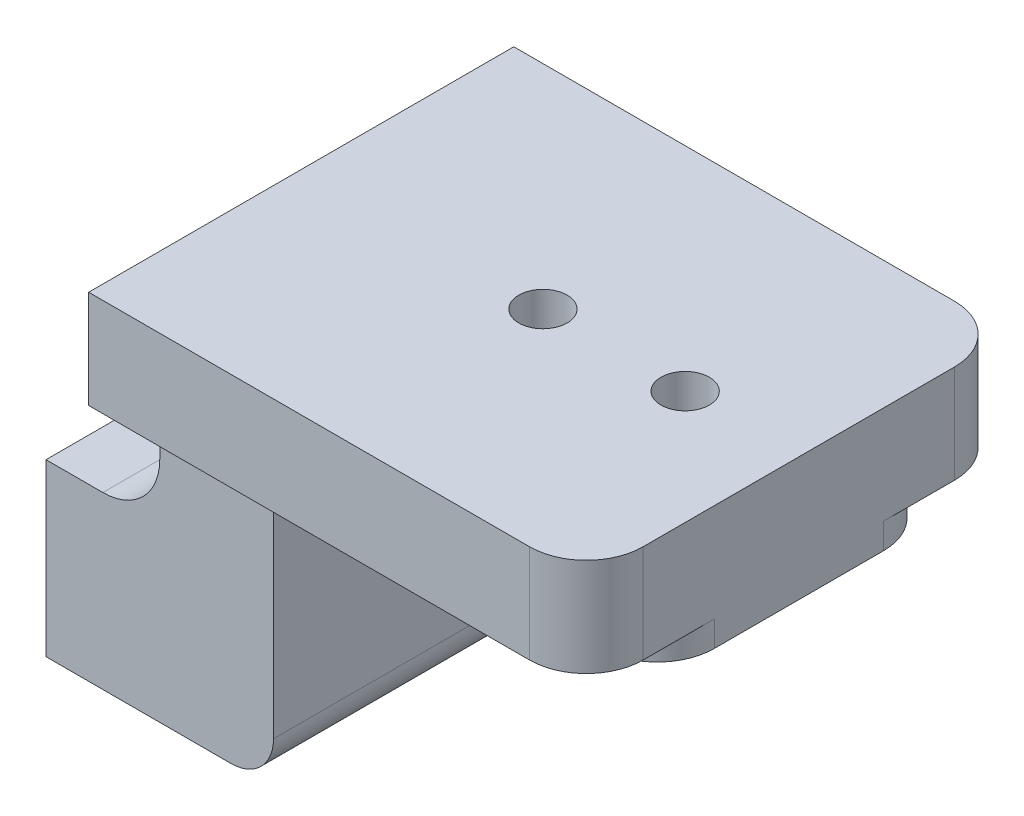
ISO-10303-21;
HEADER;
FILE_DESCRIPTION(('STEP AP214'),'2;1');
FILE_NAME('part.step','',(''),(''),'','','');
FILE_SCHEMA(('AUTOMOTIVE_DESIGN { 1 0 10303 214 1 1 1 1 }'));
ENDSEC;
DATA;
#1=APPLICATION_CONTEXT('core data for automotive mechanical design processes');
#2=APPLICATION_PROTOCOL_DEFINITION('international standard','automotive_design',2000,#1);
#3=PRODUCT_CONTEXT('',#1,'mechanical');
#4=PRODUCT('Part','Part','',(#3));
#5=PRODUCT_RELATED_PRODUCT_CATEGORY('part','',(#4));
#6=PRODUCT_DEFINITION_FORMATION('','',#4);
#7=PRODUCT_DEFINITION_CONTEXT('part definition',#1,'design');
#8=PRODUCT_DEFINITION('design','',#6,#7);
#9=PRODUCT_DEFINITION_SHAPE('','',#8);
#10=(LENGTH_UNIT() NAMED_UNIT(*) SI_UNIT(.MILLI.,.METRE.));
#11=(NAMED_UNIT(*) PLANE_ANGLE_UNIT() SI_UNIT($,.RADIAN.));
#12=(NAMED_UNIT(*) SI_UNIT($,.STERADIAN.) SOLID_ANGLE_UNIT());
#13=UNCERTAINTY_MEASURE_WITH_UNIT(LENGTH_MEASURE(1.E-05),#10,'distance_accuracy_value','');
#14=(GEOMETRIC_REPRESENTATION_CONTEXT(3) GLOBAL_UNCERTAINTY_ASSIGNED_CONTEXT((#13)) GLOBAL_UNIT_ASSIGNED_CONTEXT((#10,
#11,#12)) REPRESENTATION_CONTEXT('',''));
#15=CARTESIAN_POINT('',(0.,0.,0.));
#16=DIRECTION('',(0.,0.,1.));
#17=DIRECTION('',(1.,0.,0.));
#18=AXIS2_PLACEMENT_3D('',#15,#16,#17);
#19=CARTESIAN_POINT('',(0.,0.,0.));
#20=DIRECTION('',(1.,0.,0.));
#21=DIRECTION('',(0.,0.,-1.));
#22=AXIS2_PLACEMENT_3D('',#19,#20,#21);
#23=PLANE('',#22);
#24=CARTESIAN_POINT('',(0.,0.,-5.));
#25=DIRECTION('',(-1.,0.,0.));
#26=DIRECTION('',(0.,0.,1.));
#27=AXIS2_PLACEMENT_3D('',#24,#25,#26);
#28=CIRCLE('',#27,1.7);
#29=CARTESIAN_POINT('',(0.,0.,-3.3));
#30=VERTEX_POINT('',#29);
#31=EDGE_CURVE('E224',#30,#30,#28,.T.);
#32=ORIENTED_EDGE('',*,*,#31,.F.);
#33=EDGE_LOOP('',(#32));
#34=FACE_BOUND('',#33,.T.);
#35=CARTESIAN_POINT('',(0.,0.,5.));
#36=DIRECTION('',(-1.,0.,0.));
#37=DIRECTION('',(0.,0.,1.));
#38=AXIS2_PLACEMENT_3D('',#35,#36,#37);
#39=CIRCLE('',#38,1.7);
#40=CARTESIAN_POINT('',(0.,0.,6.69999999999999));
#41=VERTEX_POINT('',#40);
#42=EDGE_CURVE('E188',#41,#41,#39,.T.);
#43=ORIENTED_EDGE('',*,*,#42,.F.);
#44=EDGE_LOOP('',(#43));
#45=FACE_BOUND('',#44,.T.);
#46=DIRECTION('',(0.,-1.,0.));
#47=VECTOR('',#46,1.);
#48=CARTESIAN_POINT('',(0.,0.,-9.95));
#49=LINE('',#48,#47);
#50=CARTESIAN_POINT('',(0.,6.,-9.95));
#51=VERTEX_POINT('',#50);
#52=CARTESIAN_POINT('',(0.,-6.,-9.95));
#53=VERTEX_POINT('',#52);
#54=EDGE_CURVE('E11',#51,#53,#49,.T.);
#55=ORIENTED_EDGE('',*,*,#54,.T.);
#56=DIRECTION('',(0.,0.,-1.));
#57=VECTOR('',#56,1.);
#58=CARTESIAN_POINT('',(0.,-6.,10.));
#59=LINE('',#58,#57);
#60=CARTESIAN_POINT('',(0.,-6.,9.95));
#61=VERTEX_POINT('',#60);
#62=EDGE_CURVE('E217',#61,#53,#59,.T.);
#63=ORIENTED_EDGE('',*,*,#62,.F.);
#64=DIRECTION('',(0.,-1.,0.));
#65=VECTOR('',#64,1.);
#66=CARTESIAN_POINT('',(0.,0.,9.95));
#67=LINE('',#66,#65);
#68=CARTESIAN_POINT('',(0.,6.,9.95));
#69=VERTEX_POINT('',#68);
#70=EDGE_CURVE('E352',#69,#61,#67,.T.);
#71=ORIENTED_EDGE('',*,*,#70,.F.);
#72=DIRECTION('',(0.,0.,1.));
#73=VECTOR('',#72,1.);
#74=CARTESIAN_POINT('',(0.,6.,10.));
#75=LINE('',#74,#73);
#76=EDGE_CURVE('E42',#51,#69,#75,.T.);
#77=ORIENTED_EDGE('',*,*,#76,.F.);
#78=EDGE_LOOP('',(#55,#63,#71,#77));
#79=FACE_BOUND('',#78,.T.);
#80=ADVANCED_FACE('F39',(#34,#45,#79),#23,.F.);
#81=CARTESIAN_POINT('',(4.24892422621555,0.,-5.));
#82=DIRECTION('',(-1.,0.,0.));
#83=DIRECTION('',(0.,0.,1.));
#84=AXIS2_PLACEMENT_3D('',#81,#82,#83);
#85=CONICAL_SURFACE('',#84,1.25,1.02974425867665);
#86=CARTESIAN_POINT('',(5.,0.,-5.));
#87=VERTEX_POINT('',#86);
#88=VERTEX_LOOP('',#87);
#89=FACE_BOUND('',#88,.T.);
#90=CARTESIAN_POINT('',(4.24892422621555,0.,-5.));
#91=DIRECTION('',(-1.,0.,0.));
#92=DIRECTION('',(0.,0.,1.));
#93=AXIS2_PLACEMENT_3D('',#90,#91,#92);
#94=CIRCLE('',#93,1.25);
#95=CARTESIAN_POINT('',(4.24892422621555,0.,-3.75));
#96=VERTEX_POINT('',#95);
#97=EDGE_CURVE('E179',#96,#96,#94,.T.);
#98=ORIENTED_EDGE('',*,*,#97,.T.);
#99=EDGE_LOOP('',(#98));
#100=FACE_BOUND('',#99,.T.);
#101=ADVANCED_FACE('F172',(#89,#100),#85,.F.);
#102=CARTESIAN_POINT('',(-9.,0.,-5.));
#103=DIRECTION('',(-1.,0.,0.));
#104=DIRECTION('',(0.,0.,1.));
#105=AXIS2_PLACEMENT_3D('',#102,#103,#104);
#106=CYLINDRICAL_SURFACE('',#105,1.25);
#107=CARTESIAN_POINT('',(0.270387278562402,0.,-5.));
#108=DIRECTION('',(-1.,0.,0.));
#109=DIRECTION('',(0.,0.,1.));
#110=AXIS2_PLACEMENT_3D('',#107,#108,#109);
#111=CIRCLE('',#110,1.25);
#112=CARTESIAN_POINT('',(0.270387278562402,0.,-3.75));
#113=VERTEX_POINT('',#112);
#114=EDGE_CURVE('E221',#113,#113,#111,.T.);
#115=ORIENTED_EDGE('',*,*,#114,.T.);
#116=EDGE_LOOP('',(#115));
#117=FACE_BOUND('',#116,.T.);
#118=ORIENTED_EDGE('',*,*,#97,.F.);
#119=EDGE_LOOP('',(#118));
#120=FACE_BOUND('',#119,.T.);
#121=ADVANCED_FACE('F175',(#117,#120),#106,.F.);
#122=CARTESIAN_POINT('',(0.,0.,-5.));
#123=DIRECTION('',(-1.,0.,0.));
#124=DIRECTION('',(0.,0.,1.));
#125=AXIS2_PLACEMENT_3D('',#122,#123,#124);
#126=CONICAL_SURFACE('',#125,1.7,1.02974425867665);
#127=ORIENTED_EDGE('',*,*,#31,.T.);
#128=EDGE_LOOP('',(#127));
#129=FACE_BOUND('',#128,.T.);
#130=ORIENTED_EDGE('',*,*,#114,.F.);
#131=EDGE_LOOP('',(#130));
#132=FACE_BOUND('',#131,.T.);
#133=ADVANCED_FACE('F662',(#129,#132),#126,.F.);
#134=CARTESIAN_POINT('',(4.24892422621555,0.,5.));
#135=DIRECTION('',(-1.,0.,0.));
#136=DIRECTION('',(0.,0.,1.));
#137=AXIS2_PLACEMENT_3D('',#134,#135,#136);
#138=CONICAL_SURFACE('',#137,1.25,1.02974425867665);
#139=CARTESIAN_POINT('',(5.,0.,5.));
#140=VERTEX_POINT('',#139);
#141=VERTEX_LOOP('',#140);
#142=FACE_BOUND('',#141,.T.);
#143=CARTESIAN_POINT('',(4.24892422621555,0.,5.));
#144=DIRECTION('',(-1.,0.,0.));
#145=DIRECTION('',(0.,0.,1.));
#146=AXIS2_PLACEMENT_3D('',#143,#144,#145);
#147=CIRCLE('',#146,1.25);
#148=CARTESIAN_POINT('',(4.24892422621555,0.,6.24999999999999));
#149=VERTEX_POINT('',#148);
#150=EDGE_CURVE('E181',#149,#149,#147,.T.);
#151=ORIENTED_EDGE('',*,*,#150,.T.);
#152=EDGE_LOOP('',(#151));
#153=FACE_BOUND('',#152,.T.);
#154=ADVANCED_FACE('F673',(#142,#153),#138,.F.);
#155=CARTESIAN_POINT('',(-9.,0.,5.));
#156=DIRECTION('',(-1.,0.,0.));
#157=DIRECTION('',(0.,0.,1.));
#158=AXIS2_PLACEMENT_3D('',#155,#156,#157);
#159=CYLINDRICAL_SURFACE('',#158,1.25);
#160=CARTESIAN_POINT('',(0.270387278562402,0.,5.));
#161=DIRECTION('',(-1.,0.,0.));
#162=DIRECTION('',(0.,0.,1.));
#163=AXIS2_PLACEMENT_3D('',#160,#161,#162);
#164=CIRCLE('',#163,1.25);
#165=CARTESIAN_POINT('',(0.270387278562402,0.,6.25));
#166=VERTEX_POINT('',#165);
#167=EDGE_CURVE('E182',#166,#166,#164,.T.);
#168=ORIENTED_EDGE('',*,*,#167,.T.);
#169=EDGE_LOOP('',(#168));
#170=FACE_BOUND('',#169,.T.);
#171=ORIENTED_EDGE('',*,*,#150,.F.);
#172=EDGE_LOOP('',(#171));
#173=FACE_BOUND('',#172,.T.);
#174=ADVANCED_FACE('F668',(#170,#173),#159,.F.);
#175=CARTESIAN_POINT('',(0.,0.,5.));
#176=DIRECTION('',(-1.,0.,0.));
#177=DIRECTION('',(0.,0.,1.));
#178=AXIS2_PLACEMENT_3D('',#175,#176,#177);
#179=CONICAL_SURFACE('',#178,1.7,1.02974425867665);
#180=ORIENTED_EDGE('',*,*,#42,.T.);
#181=EDGE_LOOP('',(#180));
#182=FACE_BOUND('',#181,.T.);
#183=ORIENTED_EDGE('',*,*,#167,.F.);
#184=EDGE_LOOP('',(#183));
#185=FACE_BOUND('',#184,.T.);
#186=ADVANCED_FACE('F672',(#182,#185),#179,.F.);
#187=CARTESIAN_POINT('',(16.,14.,10.));
#188=DIRECTION('',(-1.,0.,0.));
#189=DIRECTION('',(0.,0.,1.));
#190=AXIS2_PLACEMENT_3D('',#187,#188,#189);
#191=PLANE('',#190);
#192=DIRECTION('',(0.,1.,0.));
#193=VECTOR('',#192,1.);
#194=CARTESIAN_POINT('',(16.,0.,9.95));
#195=LINE('',#194,#193);
#196=CARTESIAN_POINT('',(16.,-3.,9.95));
#197=VERTEX_POINT('',#196);
#198=CARTESIAN_POINT('',(16.,11.,9.95));
#199=VERTEX_POINT('',#198);
#200=EDGE_CURVE('E245',#197,#199,#195,.T.);
#201=ORIENTED_EDGE('',*,*,#200,.F.);
#202=DIRECTION('',(0.,0.,-1.));
#203=VECTOR('',#202,1.);
#204=CARTESIAN_POINT('',(16.,-3.,10.));
#205=LINE('',#204,#203);
#206=CARTESIAN_POINT('',(16.,-3.,-9.95));
#207=VERTEX_POINT('',#206);
#208=EDGE_CURVE('E289',#197,#207,#205,.T.);
#209=ORIENTED_EDGE('',*,*,#208,.T.);
#210=DIRECTION('',(0.,1.,0.));
#211=VECTOR('',#210,1.);
#212=CARTESIAN_POINT('',(16.,0.,-9.95));
#213=LINE('',#212,#211);
#214=CARTESIAN_POINT('',(16.,11.,-9.95));
#215=VERTEX_POINT('',#214);
#216=EDGE_CURVE('E264',#207,#215,#213,.T.);
#217=ORIENTED_EDGE('',*,*,#216,.T.);
#218=DIRECTION('',(0.,0.,-1.));
#219=VECTOR('',#218,1.);
#220=CARTESIAN_POINT('',(16.,11.,10.));
#221=LINE('',#220,#219);
#222=EDGE_CURVE('E218',#215,#199,#221,.F.);
#223=ORIENTED_EDGE('',*,*,#222,.T.);
#224=EDGE_LOOP('',(#201,#209,#217,#223));
#225=FACE_BOUND('',#224,.T.);
#226=ADVANCED_FACE('F368',(#225),#191,.F.);
#227=CARTESIAN_POINT('',(8.,6.,10.));
#228=DIRECTION('',(1.,0.,0.));
#229=DIRECTION('',(0.,0.,-1.));
#230=AXIS2_PLACEMENT_3D('',#227,#228,#229);
#231=PLANE('',#230);
#232=DIRECTION('',(0.,-1.,0.));
#233=VECTOR('',#232,1.);
#234=CARTESIAN_POINT('',(8.,0.,-9.95));
#235=LINE('',#234,#233);
#236=CARTESIAN_POINT('',(8.,15.8,-9.95));
#237=VERTEX_POINT('',#236);
#238=CARTESIAN_POINT('',(8.,10.,-9.95));
#239=VERTEX_POINT('',#238);
#240=EDGE_CURVE('E260',#237,#239,#235,.T.);
#241=ORIENTED_EDGE('',*,*,#240,.T.);
#242=DIRECTION('',(0.,0.,-1.));
#243=VECTOR('',#242,1.);
#244=CARTESIAN_POINT('',(8.,10.,9.95));
#245=LINE('',#244,#243);
#246=CARTESIAN_POINT('',(8.,10.,9.95));
#247=VERTEX_POINT('',#246);
#248=EDGE_CURVE('E309',#239,#247,#245,.F.);
#249=ORIENTED_EDGE('',*,*,#248,.T.);
#250=DIRECTION('',(0.,-1.,0.));
#251=VECTOR('',#250,1.);
#252=CARTESIAN_POINT('',(8.,0.,9.95));
#253=LINE('',#252,#251);
#254=CARTESIAN_POINT('',(8.,15.8,9.95));
#255=VERTEX_POINT('',#254);
#256=EDGE_CURVE('E242',#255,#247,#253,.T.);
#257=ORIENTED_EDGE('',*,*,#256,.F.);
#258=DIRECTION('',(0.,0.,-1.));
#259=VECTOR('',#258,1.);
#260=CARTESIAN_POINT('',(8.,15.8,10.));
#261=LINE('',#260,#259);
#262=CARTESIAN_POINT('',(8.,15.8,14.95));
#263=VERTEX_POINT('',#262);
#264=EDGE_CURVE('E216',#263,#255,#261,.T.);
#265=ORIENTED_EDGE('',*,*,#264,.F.);
#266=DIRECTION('',(0.,-1.,0.));
#267=VECTOR('',#266,1.);
#268=CARTESIAN_POINT('',(8.,6.,14.95));
#269=LINE('',#268,#267);
#270=CARTESIAN_POINT('',(8.,22.7,14.95));
#271=VERTEX_POINT('',#270);
#272=EDGE_CURVE('E248',#271,#263,#269,.T.);
#273=ORIENTED_EDGE('',*,*,#272,.F.);
#274=DIRECTION('',(0.,0.,1.));
#275=VECTOR('',#274,1.);
#276=CARTESIAN_POINT('',(8.,22.7,10.));
#277=LINE('',#276,#275);
#278=CARTESIAN_POINT('',(8.,22.7,-14.95));
#279=VERTEX_POINT('',#278);
#280=EDGE_CURVE('E251',#279,#271,#277,.T.);
#281=ORIENTED_EDGE('',*,*,#280,.F.);
#282=DIRECTION('',(0.,1.,0.));
#283=VECTOR('',#282,1.);
#284=CARTESIAN_POINT('',(8.,6.,-14.95));
#285=LINE('',#284,#283);
#286=CARTESIAN_POINT('',(8.,15.8,-14.95));
#287=VERTEX_POINT('',#286);
#288=EDGE_CURVE('E254',#287,#279,#285,.T.);
#289=ORIENTED_EDGE('',*,*,#288,.F.);
#290=DIRECTION('',(0.,0.,-1.));
#291=VECTOR('',#290,1.);
#292=CARTESIAN_POINT('',(8.,15.8,10.));
#293=LINE('',#292,#291);
#294=EDGE_CURVE('E257',#237,#287,#293,.T.);
#295=ORIENTED_EDGE('',*,*,#294,.F.);
#296=EDGE_LOOP('',(#241,#249,#257,#265,#273,#281,#289,#295));
#297=FACE_BOUND('',#296,.T.);
#298=ADVANCED_FACE('F390',(#297),#231,.F.);
#299=CARTESIAN_POINT('',(0.,6.,10.));
#300=DIRECTION('',(0.,-1.,0.));
#301=DIRECTION('',(0.,0.,-1.));
#302=AXIS2_PLACEMENT_3D('',#299,#300,#301);
#303=PLANE('',#302);
#304=DIRECTION('',(-1.,0.,0.));
#305=VECTOR('',#304,1.);
#306=CARTESIAN_POINT('',(0.,6.,-9.95));
#307=LINE('',#306,#305);
#308=CARTESIAN_POINT('',(4.,6.,-9.95));
#309=VERTEX_POINT('',#308);
#310=EDGE_CURVE('E263',#309,#51,#307,.T.);
#311=ORIENTED_EDGE('',*,*,#310,.T.);
#312=ORIENTED_EDGE('',*,*,#76,.T.);
#313=DIRECTION('',(-1.,0.,0.));
#314=VECTOR('',#313,1.);
#315=CARTESIAN_POINT('',(0.,6.,9.95));
#316=LINE('',#315,#314);
#317=CARTESIAN_POINT('',(4.,6.,9.95));
#318=VERTEX_POINT('',#317);
#319=EDGE_CURVE('E239',#318,#69,#316,.T.);
#320=ORIENTED_EDGE('',*,*,#319,.F.);
#321=DIRECTION('',(0.,0.,-1.));
#322=VECTOR('',#321,1.);
#323=CARTESIAN_POINT('',(4.,6.,-9.95));
#324=LINE('',#323,#322);
#325=EDGE_CURVE('E306',#318,#309,#324,.T.);
#326=ORIENTED_EDGE('',*,*,#325,.T.);
#327=EDGE_LOOP('',(#311,#312,#320,#326));
#328=FACE_BOUND('',#327,.T.);
#329=ADVANCED_FACE('F398',(#328),#303,.F.);
#330=CARTESIAN_POINT('',(16.,-6.,10.));
#331=DIRECTION('',(0.,1.,0.));
#332=DIRECTION('',(0.,0.,1.));
#333=AXIS2_PLACEMENT_3D('',#330,#331,#332);
#334=PLANE('',#333);
#335=DIRECTION('',(1.,0.,0.));
#336=VECTOR('',#335,1.);
#337=CARTESIAN_POINT('',(0.,-6.,-9.95));
#338=LINE('',#337,#336);
#339=CARTESIAN_POINT('',(13.,-6.,-9.95));
#340=VERTEX_POINT('',#339);
#341=EDGE_CURVE('E266',#53,#340,#338,.T.);
#342=ORIENTED_EDGE('',*,*,#341,.T.);
#343=DIRECTION('',(0.,0.,-1.));
#344=VECTOR('',#343,1.);
#345=CARTESIAN_POINT('',(13.,-6.,10.));
#346=LINE('',#345,#344);
#347=CARTESIAN_POINT('',(13.,-6.,9.95));
#348=VERTEX_POINT('',#347);
#349=EDGE_CURVE('E294',#340,#348,#346,.F.);
#350=ORIENTED_EDGE('',*,*,#349,.T.);
#351=DIRECTION('',(1.,0.,0.));
#352=VECTOR('',#351,1.);
#353=CARTESIAN_POINT('',(0.,-6.,9.95));
#354=LINE('',#353,#352);
#355=EDGE_CURVE('E219',#61,#348,#354,.T.);
#356=ORIENTED_EDGE('',*,*,#355,.F.);
#357=ORIENTED_EDGE('',*,*,#62,.T.);
#358=EDGE_LOOP('',(#342,#350,#356,#357));
#359=FACE_BOUND('',#358,.T.);
#360=ADVANCED_FACE('F360',(#359),#334,.F.);
#361=CARTESIAN_POINT('',(0.,0.,9.95));
#362=DIRECTION('',(0.,0.,-1.));
#363=DIRECTION('',(-1.,0.,0.));
#364=AXIS2_PLACEMENT_3D('',#361,#362,#363);
#365=PLANE('',#364);
#366=ORIENTED_EDGE('',*,*,#319,.T.);
#367=ORIENTED_EDGE('',*,*,#70,.T.);
#368=ORIENTED_EDGE('',*,*,#355,.T.);
#369=CARTESIAN_POINT('',(13.,-3.,9.95));
#370=DIRECTION('',(0.,0.,-1.));
#371=DIRECTION('',(-1.,0.,0.));
#372=AXIS2_PLACEMENT_3D('',#369,#370,#371);
#373=CIRCLE('',#372,3.);
#374=EDGE_CURVE('E296',#348,#197,#373,.F.);
#375=ORIENTED_EDGE('',*,*,#374,.T.);
#376=ORIENTED_EDGE('',*,*,#200,.T.);
#377=CARTESIAN_POINT('',(19.,11.,9.95));
#378=DIRECTION('',(0.,0.,-1.));
#379=DIRECTION('',(-1.,0.,0.));
#380=AXIS2_PLACEMENT_3D('',#377,#378,#379);
#381=CIRCLE('',#380,3.);
#382=CARTESIAN_POINT('',(19.,14.,9.95));
#383=VERTEX_POINT('',#382);
#384=EDGE_CURVE('E303',#199,#383,#381,.T.);
#385=ORIENTED_EDGE('',*,*,#384,.T.);
#386=DIRECTION('',(-1.,0.,0.));
#387=VECTOR('',#386,1.);
#388=CARTESIAN_POINT('',(0.,14.,9.95));
#389=LINE('',#388,#387);
#390=CARTESIAN_POINT('',(39.,14.,9.95));
#391=VERTEX_POINT('',#390);
#392=EDGE_CURVE('E228',#391,#383,#389,.T.);
#393=ORIENTED_EDGE('',*,*,#392,.F.);
#394=DIRECTION('',(0.,1.,0.));
#395=VECTOR('',#394,1.);
#396=CARTESIAN_POINT('',(39.,0.,9.95));
#397=LINE('',#396,#395);
#398=CARTESIAN_POINT('',(39.,15.8,9.95));
#399=VERTEX_POINT('',#398);
#400=EDGE_CURVE('E333',#391,#399,#397,.T.);
#401=ORIENTED_EDGE('',*,*,#400,.T.);
#402=DIRECTION('',(-1.,0.,0.));
#403=VECTOR('',#402,1.);
#404=CARTESIAN_POINT('',(0.,15.8,9.95));
#405=LINE('',#404,#403);
#406=EDGE_CURVE('E225',#399,#255,#405,.T.);
#407=ORIENTED_EDGE('',*,*,#406,.T.);
#408=ORIENTED_EDGE('',*,*,#256,.T.);
#409=CARTESIAN_POINT('',(4.,10.,9.95));
#410=DIRECTION('',(0.,0.,-1.));
#411=DIRECTION('',(-1.,0.,0.));
#412=AXIS2_PLACEMENT_3D('',#409,#410,#411);
#413=CIRCLE('',#412,4.);
#414=EDGE_CURVE('E313',#247,#318,#413,.T.);
#415=ORIENTED_EDGE('',*,*,#414,.T.);
#416=EDGE_LOOP('',(#366,#367,#368,#375,#376,#385,#393,#401,#407,#408,#415));
#417=FACE_BOUND('',#416,.T.);
#418=ADVANCED_FACE('F355',(#417),#365,.F.);
#419=CARTESIAN_POINT('',(0.,0.,-9.95));
#420=DIRECTION('',(0.,0.,-1.));
#421=DIRECTION('',(-1.,0.,0.));
#422=AXIS2_PLACEMENT_3D('',#419,#420,#421);
#423=PLANE('',#422);
#424=ORIENTED_EDGE('',*,*,#54,.F.);
#425=ORIENTED_EDGE('',*,*,#310,.F.);
#426=CARTESIAN_POINT('',(4.,10.,-9.95));
#427=DIRECTION('',(0.,0.,-1.));
#428=DIRECTION('',(-1.,0.,0.));
#429=AXIS2_PLACEMENT_3D('',#426,#427,#428);
#430=CIRCLE('',#429,4.);
#431=EDGE_CURVE('E311',#309,#239,#430,.F.);
#432=ORIENTED_EDGE('',*,*,#431,.T.);
#433=ORIENTED_EDGE('',*,*,#240,.F.);
#434=DIRECTION('',(-1.,0.,0.));
#435=VECTOR('',#434,1.);
#436=CARTESIAN_POINT('',(0.,15.8,-9.95));
#437=LINE('',#436,#435);
#438=CARTESIAN_POINT('',(39.,15.8,-9.95));
#439=VERTEX_POINT('',#438);
#440=EDGE_CURVE('E236',#439,#237,#437,.T.);
#441=ORIENTED_EDGE('',*,*,#440,.F.);
#442=DIRECTION('',(0.,-1.,0.));
#443=VECTOR('',#442,1.);
#444=CARTESIAN_POINT('',(39.,14.,-9.95));
#445=LINE('',#444,#443);
#446=CARTESIAN_POINT('',(39.,14.,-9.95));
#447=VERTEX_POINT('',#446);
#448=EDGE_CURVE('E340',#439,#447,#445,.T.);
#449=ORIENTED_EDGE('',*,*,#448,.T.);
#450=DIRECTION('',(-1.,0.,0.));
#451=VECTOR('',#450,1.);
#452=CARTESIAN_POINT('',(0.,14.,-9.95));
#453=LINE('',#452,#451);
#454=CARTESIAN_POINT('',(19.,14.,-9.95));
#455=VERTEX_POINT('',#454);
#456=EDGE_CURVE('E238',#447,#455,#453,.T.);
#457=ORIENTED_EDGE('',*,*,#456,.T.);
#458=CARTESIAN_POINT('',(19.,11.,-9.95));
#459=DIRECTION('',(0.,0.,-1.));
#460=DIRECTION('',(-1.,0.,0.));
#461=AXIS2_PLACEMENT_3D('',#458,#459,#460);
#462=CIRCLE('',#461,3.);
#463=EDGE_CURVE('E301',#455,#215,#462,.F.);
#464=ORIENTED_EDGE('',*,*,#463,.T.);
#465=ORIENTED_EDGE('',*,*,#216,.F.);
#466=CARTESIAN_POINT('',(13.,-3.,-9.95));
#467=DIRECTION('',(0.,0.,-1.));
#468=DIRECTION('',(-1.,0.,0.));
#469=AXIS2_PLACEMENT_3D('',#466,#467,#468);
#470=CIRCLE('',#469,3.);
#471=EDGE_CURVE('E292',#207,#340,#470,.T.);
#472=ORIENTED_EDGE('',*,*,#471,.T.);
#473=ORIENTED_EDGE('',*,*,#341,.F.);
#474=EDGE_LOOP('',(#424,#425,#432,#433,#441,#449,#457,#464,#465,#472,#473));
#475=FACE_BOUND('',#474,.T.);
#476=ADVANCED_FACE('F401',(#475),#423,.T.);
#477=CARTESIAN_POINT('',(43.,14.,10.));
#478=DIRECTION('',(0.,-1.,0.));
#479=DIRECTION('',(1.,0.,0.));
#480=AXIS2_PLACEMENT_3D('',#477,#478,#479);
#481=PLANE('',#480);
#482=CARTESIAN_POINT('',(25.,14.,0.));
#483=DIRECTION('',(0.,-1.,0.));
#484=DIRECTION('',(0.,0.,-1.));
#485=AXIS2_PLACEMENT_3D('',#482,#483,#484);
#486=CIRCLE('',#485,3.25);
#487=CARTESIAN_POINT('',(25.,14.,-3.25));
#488=VERTEX_POINT('',#487);
#489=EDGE_CURVE('E185',#488,#488,#486,.T.);
#490=ORIENTED_EDGE('',*,*,#489,.F.);
#491=EDGE_LOOP('',(#490));
#492=FACE_BOUND('',#491,.T.);
#493=CARTESIAN_POINT('',(35.,14.,0.));
#494=DIRECTION('',(0.,-1.,0.));
#495=DIRECTION('',(0.,0.,-1.));
#496=AXIS2_PLACEMENT_3D('',#493,#494,#495);
#497=CIRCLE('',#496,3.25);
#498=CARTESIAN_POINT('',(35.,14.,-3.25));
#499=VERTEX_POINT('',#498);
#500=EDGE_CURVE('E202',#499,#499,#497,.T.);
#501=ORIENTED_EDGE('',*,*,#500,.F.);
#502=EDGE_LOOP('',(#501));
#503=FACE_BOUND('',#502,.T.);
#504=DIRECTION('',(0.,0.,1.));
#505=VECTOR('',#504,1.);
#506=CARTESIAN_POINT('',(43.,14.,10.));
#507=LINE('',#506,#505);
#508=CARTESIAN_POINT('',(43.,14.,-5.95));
#509=VERTEX_POINT('',#508);
#510=CARTESIAN_POINT('',(43.,14.,5.95));
#511=VERTEX_POINT('',#510);
#512=EDGE_CURVE('E212',#509,#511,#507,.T.);
#513=ORIENTED_EDGE('',*,*,#512,.T.);
#514=CARTESIAN_POINT('',(39.,14.,5.95));
#515=DIRECTION('',(0.,-1.,0.));
#516=DIRECTION('',(1.,0.,0.));
#517=AXIS2_PLACEMENT_3D('',#514,#515,#516);
#518=CIRCLE('',#517,4.);
#519=EDGE_CURVE('E338',#511,#391,#518,.T.);
#520=ORIENTED_EDGE('',*,*,#519,.T.);
#521=ORIENTED_EDGE('',*,*,#392,.T.);
#522=DIRECTION('',(0.,0.,-1.));
#523=VECTOR('',#522,1.);
#524=CARTESIAN_POINT('',(19.,14.,10.));
#525=LINE('',#524,#523);
#526=EDGE_CURVE('E298',#383,#455,#525,.T.);
#527=ORIENTED_EDGE('',*,*,#526,.T.);
#528=ORIENTED_EDGE('',*,*,#456,.F.);
#529=CARTESIAN_POINT('',(39.,14.,-5.95));
#530=DIRECTION('',(0.,-1.,0.));
#531=DIRECTION('',(1.,0.,0.));
#532=AXIS2_PLACEMENT_3D('',#529,#530,#531);
#533=CIRCLE('',#532,4.);
#534=EDGE_CURVE('E336',#447,#509,#533,.T.);
#535=ORIENTED_EDGE('',*,*,#534,.T.);
#536=EDGE_LOOP('',(#513,#520,#521,#527,#528,#535));
#537=FACE_BOUND('',#536,.T.);
#538=ADVANCED_FACE('F405',(#492,#503,#537),#481,.T.);
#539=CARTESIAN_POINT('',(43.,15.8,10.));
#540=DIRECTION('',(0.,-1.,0.));
#541=DIRECTION('',(1.,0.,0.));
#542=AXIS2_PLACEMENT_3D('',#539,#540,#541);
#543=PLANE('',#542);
#544=DIRECTION('',(-1.,0.,0.));
#545=VECTOR('',#544,1.);
#546=CARTESIAN_POINT('',(43.,15.8,-14.95));
#547=LINE('',#546,#545);
#548=CARTESIAN_POINT('',(39.,15.8,-14.95));
#549=VERTEX_POINT('',#548);
#550=EDGE_CURVE('E234',#549,#287,#547,.T.);
#551=ORIENTED_EDGE('',*,*,#550,.F.);
#552=CARTESIAN_POINT('',(39.,15.8,-10.95));
#553=DIRECTION('',(0.,-1.,0.));
#554=DIRECTION('',(1.,0.,0.));
#555=AXIS2_PLACEMENT_3D('',#552,#553,#554);
#556=CIRCLE('',#555,4.);
#557=CARTESIAN_POINT('',(43.,15.8,-10.95));
#558=VERTEX_POINT('',#557);
#559=EDGE_CURVE('E346',#549,#558,#556,.T.);
#560=ORIENTED_EDGE('',*,*,#559,.T.);
#561=DIRECTION('',(0.,0.,1.));
#562=VECTOR('',#561,1.);
#563=CARTESIAN_POINT('',(43.,15.8,0.));
#564=LINE('',#563,#562);
#565=CARTESIAN_POINT('',(43.,15.8,-5.95));
#566=VERTEX_POINT('',#565);
#567=EDGE_CURVE('E272',#558,#566,#564,.T.);
#568=ORIENTED_EDGE('',*,*,#567,.T.);
#569=CARTESIAN_POINT('',(39.,15.8,-5.95));
#570=DIRECTION('',(0.,-1.,0.));
#571=DIRECTION('',(1.,0.,0.));
#572=AXIS2_PLACEMENT_3D('',#569,#570,#571);
#573=CIRCLE('',#572,4.);
#574=EDGE_CURVE('E351',#566,#439,#573,.F.);
#575=ORIENTED_EDGE('',*,*,#574,.T.);
#576=ORIENTED_EDGE('',*,*,#440,.T.);
#577=ORIENTED_EDGE('',*,*,#294,.T.);
#578=EDGE_LOOP('',(#551,#560,#568,#575,#576,#577));
#579=FACE_BOUND('',#578,.T.);
#580=ADVANCED_FACE('F417',(#579),#543,.T.);
#581=CARTESIAN_POINT('',(43.,14.,-14.95));
#582=DIRECTION('',(0.,0.,-1.));
#583=DIRECTION('',(-1.,0.,0.));
#584=AXIS2_PLACEMENT_3D('',#581,#582,#583);
#585=PLANE('',#584);
#586=DIRECTION('',(-1.,0.,0.));
#587=VECTOR('',#586,1.);
#588=CARTESIAN_POINT('',(43.,22.7,-14.95));
#589=LINE('',#588,#587);
#590=CARTESIAN_POINT('',(39.,22.7,-14.95));
#591=VERTEX_POINT('',#590);
#592=EDGE_CURVE('E232',#591,#279,#589,.T.);
#593=ORIENTED_EDGE('',*,*,#592,.F.);
#594=DIRECTION('',(0.,-1.,0.));
#595=VECTOR('',#594,1.);
#596=CARTESIAN_POINT('',(39.,15.8,-14.95));
#597=LINE('',#596,#595);
#598=EDGE_CURVE('E343',#591,#549,#597,.T.);
#599=ORIENTED_EDGE('',*,*,#598,.T.);
#600=ORIENTED_EDGE('',*,*,#550,.T.);
#601=ORIENTED_EDGE('',*,*,#288,.T.);
#602=EDGE_LOOP('',(#593,#599,#600,#601));
#603=FACE_BOUND('',#602,.T.);
#604=ADVANCED_FACE('F422',(#603),#585,.T.);
#605=CARTESIAN_POINT('',(43.,22.7,10.));
#606=DIRECTION('',(0.,1.,0.));
#607=DIRECTION('',(-1.,0.,0.));
#608=AXIS2_PLACEMENT_3D('',#605,#606,#607);
#609=PLANE('',#608);
#610=CARTESIAN_POINT('',(25.,22.7,0.));
#611=DIRECTION('',(0.,1.,0.));
#612=DIRECTION('',(-1.,0.,0.));
#613=AXIS2_PLACEMENT_3D('',#610,#611,#612);
#614=CIRCLE('',#613,1.7);
#615=CARTESIAN_POINT('',(23.3,22.7,0.));
#616=VERTEX_POINT('',#615);
#617=EDGE_CURVE('E201',#616,#616,#614,.F.);
#618=ORIENTED_EDGE('',*,*,#617,.T.);
#619=EDGE_LOOP('',(#618));
#620=FACE_BOUND('',#619,.T.);
#621=CARTESIAN_POINT('',(35.,22.7,0.));
#622=DIRECTION('',(0.,1.,0.));
#623=DIRECTION('',(-1.,0.,0.));
#624=AXIS2_PLACEMENT_3D('',#621,#622,#623);
#625=CIRCLE('',#624,1.7);
#626=CARTESIAN_POINT('',(33.3,22.7,0.));
#627=VERTEX_POINT('',#626);
#628=EDGE_CURVE('E211',#627,#627,#625,.F.);
#629=ORIENTED_EDGE('',*,*,#628,.T.);
#630=EDGE_LOOP('',(#629));
#631=FACE_BOUND('',#630,.T.);
#632=DIRECTION('',(-1.,0.,0.));
#633=VECTOR('',#632,1.);
#634=CARTESIAN_POINT('',(43.,22.7,14.95));
#635=LINE('',#634,#633);
#636=CARTESIAN_POINT('',(39.,22.7,14.95));
#637=VERTEX_POINT('',#636);
#638=EDGE_CURVE('E230',#637,#271,#635,.T.);
#639=ORIENTED_EDGE('',*,*,#638,.F.);
#640=CARTESIAN_POINT('',(39.,22.7,10.95));
#641=DIRECTION('',(0.,1.,0.));
#642=DIRECTION('',(-1.,0.,0.));
#643=AXIS2_PLACEMENT_3D('',#640,#641,#642);
#644=CIRCLE('',#643,4.);
#645=CARTESIAN_POINT('',(43.,22.7,10.95));
#646=VERTEX_POINT('',#645);
#647=EDGE_CURVE('E320',#637,#646,#644,.T.);
#648=ORIENTED_EDGE('',*,*,#647,.T.);
#649=DIRECTION('',(0.,0.,-1.));
#650=VECTOR('',#649,1.);
#651=CARTESIAN_POINT('',(43.,22.7,0.));
#652=LINE('',#651,#650);
#653=CARTESIAN_POINT('',(43.,22.7,-10.95));
#654=VERTEX_POINT('',#653);
#655=EDGE_CURVE('E274',#646,#654,#652,.T.);
#656=ORIENTED_EDGE('',*,*,#655,.T.);
#657=CARTESIAN_POINT('',(39.,22.7,-10.95));
#658=DIRECTION('',(0.,1.,0.));
#659=DIRECTION('',(-1.,0.,0.));
#660=AXIS2_PLACEMENT_3D('',#657,#658,#659);
#661=CIRCLE('',#660,4.);
#662=EDGE_CURVE('E318',#654,#591,#661,.T.);
#663=ORIENTED_EDGE('',*,*,#662,.T.);
#664=ORIENTED_EDGE('',*,*,#592,.T.);
#665=ORIENTED_EDGE('',*,*,#280,.T.);
#666=EDGE_LOOP('',(#639,#648,#656,#663,#664,#665));
#667=FACE_BOUND('',#666,.T.);
#668=ADVANCED_FACE('F431',(#620,#631,#667),#609,.T.);
#669=CARTESIAN_POINT('',(43.,14.,14.95));
#670=DIRECTION('',(0.,0.,1.));
#671=DIRECTION('',(1.,0.,0.));
#672=AXIS2_PLACEMENT_3D('',#669,#670,#671);
#673=PLANE('',#672);
#674=DIRECTION('',(-1.,0.,0.));
#675=VECTOR('',#674,1.);
#676=CARTESIAN_POINT('',(43.,15.8,14.95));
#677=LINE('',#676,#675);
#678=CARTESIAN_POINT('',(39.,15.8,14.95));
#679=VERTEX_POINT('',#678);
#680=EDGE_CURVE('E227',#679,#263,#677,.T.);
#681=ORIENTED_EDGE('',*,*,#680,.F.);
#682=DIRECTION('',(0.,1.,0.));
#683=VECTOR('',#682,1.);
#684=CARTESIAN_POINT('',(39.,22.7,14.95));
#685=LINE('',#684,#683);
#686=EDGE_CURVE('E315',#679,#637,#685,.T.);
#687=ORIENTED_EDGE('',*,*,#686,.T.);
#688=ORIENTED_EDGE('',*,*,#638,.T.);
#689=ORIENTED_EDGE('',*,*,#272,.T.);
#690=EDGE_LOOP('',(#681,#687,#688,#689));
#691=FACE_BOUND('',#690,.T.);
#692=ADVANCED_FACE('F437',(#691),#673,.T.);
#693=CARTESIAN_POINT('',(43.,15.8,10.));
#694=DIRECTION('',(0.,-1.,0.));
#695=DIRECTION('',(1.,0.,0.));
#696=AXIS2_PLACEMENT_3D('',#693,#694,#695);
#697=PLANE('',#696);
#698=DIRECTION('',(0.,0.,1.));
#699=VECTOR('',#698,1.);
#700=CARTESIAN_POINT('',(43.,15.8,0.));
#701=LINE('',#700,#699);
#702=CARTESIAN_POINT('',(43.,15.8,5.95));
#703=VERTEX_POINT('',#702);
#704=CARTESIAN_POINT('',(43.,15.8,10.95));
#705=VERTEX_POINT('',#704);
#706=EDGE_CURVE('E215',#703,#705,#701,.T.);
#707=ORIENTED_EDGE('',*,*,#706,.T.);
#708=CARTESIAN_POINT('',(39.,15.8,10.95));
#709=DIRECTION('',(0.,-1.,0.));
#710=DIRECTION('',(1.,0.,0.));
#711=AXIS2_PLACEMENT_3D('',#708,#709,#710);
#712=CIRCLE('',#711,4.);
#713=EDGE_CURVE('E331',#705,#679,#712,.T.);
#714=ORIENTED_EDGE('',*,*,#713,.T.);
#715=ORIENTED_EDGE('',*,*,#680,.T.);
#716=ORIENTED_EDGE('',*,*,#264,.T.);
#717=ORIENTED_EDGE('',*,*,#406,.F.);
#718=CARTESIAN_POINT('',(39.,15.8,5.95));
#719=DIRECTION('',(0.,-1.,0.));
#720=DIRECTION('',(1.,0.,0.));
#721=AXIS2_PLACEMENT_3D('',#718,#719,#720);
#722=CIRCLE('',#721,4.);
#723=EDGE_CURVE('E348',#399,#703,#722,.F.);
#724=ORIENTED_EDGE('',*,*,#723,.T.);
#725=EDGE_LOOP('',(#707,#714,#715,#716,#717,#724));
#726=FACE_BOUND('',#725,.T.);
#727=ADVANCED_FACE('F384',(#726),#697,.T.);
#728=CARTESIAN_POINT('',(43.,0.,0.));
#729=DIRECTION('',(-1.,0.,0.));
#730=DIRECTION('',(0.,0.,1.));
#731=AXIS2_PLACEMENT_3D('',#728,#729,#730);
#732=PLANE('',#731);
#733=ORIENTED_EDGE('',*,*,#655,.F.);
#734=DIRECTION('',(0.,1.,0.));
#735=VECTOR('',#734,1.);
#736=CARTESIAN_POINT('',(43.,15.8,10.95));
#737=LINE('',#736,#735);
#738=EDGE_CURVE('E329',#646,#705,#737,.F.);
#739=ORIENTED_EDGE('',*,*,#738,.T.);
#740=ORIENTED_EDGE('',*,*,#706,.F.);
#741=DIRECTION('',(0.,1.,0.));
#742=VECTOR('',#741,1.);
#743=CARTESIAN_POINT('',(43.,0.,5.95));
#744=LINE('',#743,#742);
#745=EDGE_CURVE('E327',#703,#511,#744,.F.);
#746=ORIENTED_EDGE('',*,*,#745,.T.);
#747=ORIENTED_EDGE('',*,*,#512,.F.);
#748=DIRECTION('',(0.,-1.,0.));
#749=VECTOR('',#748,1.);
#750=CARTESIAN_POINT('',(43.,15.8,-5.95));
#751=LINE('',#750,#749);
#752=EDGE_CURVE('E324',#509,#566,#751,.F.);
#753=ORIENTED_EDGE('',*,*,#752,.T.);
#754=ORIENTED_EDGE('',*,*,#567,.F.);
#755=DIRECTION('',(0.,-1.,0.));
#756=VECTOR('',#755,1.);
#757=CARTESIAN_POINT('',(43.,22.7,-10.95));
#758=LINE('',#757,#756);
#759=EDGE_CURVE('E322',#558,#654,#758,.F.);
#760=ORIENTED_EDGE('',*,*,#759,.T.);
#761=EDGE_LOOP('',(#733,#739,#740,#746,#747,#753,#754,#760));
#762=FACE_BOUND('',#761,.T.);
#763=ADVANCED_FACE('F411',(#762),#732,.F.);
#764=CARTESIAN_POINT('',(35.,14.,0.));
#765=DIRECTION('',(0.,-1.,0.));
#766=DIRECTION('',(0.,0.,-1.));
#767=AXIS2_PLACEMENT_3D('',#764,#765,#766);
#768=CYLINDRICAL_SURFACE('',#767,1.7);
#769=ORIENTED_EDGE('',*,*,#628,.F.);
#770=EDGE_LOOP('',(#769));
#771=FACE_BOUND('',#770,.T.);
#772=CARTESIAN_POINT('',(35.,17.,0.));
#773=DIRECTION('',(0.,-1.,0.));
#774=DIRECTION('',(0.,0.,-1.));
#775=AXIS2_PLACEMENT_3D('',#772,#773,#774);
#776=CIRCLE('',#775,1.7);
#777=CARTESIAN_POINT('',(35.,17.,-1.7));
#778=VERTEX_POINT('',#777);
#779=EDGE_CURVE('E208',#778,#778,#776,.T.);
#780=ORIENTED_EDGE('',*,*,#779,.T.);
#781=EDGE_LOOP('',(#780));
#782=FACE_BOUND('',#781,.T.);
#783=ADVANCED_FACE('F512',(#771,#782),#768,.F.);
#784=CARTESIAN_POINT('',(36.7,17.,0.));
#785=DIRECTION('',(0.,1.,0.));
#786=DIRECTION('',(0.,0.,1.));
#787=AXIS2_PLACEMENT_3D('',#784,#785,#786);
#788=PLANE('',#787);
#789=ORIENTED_EDGE('',*,*,#779,.F.);
#790=EDGE_LOOP('',(#789));
#791=FACE_BOUND('',#790,.T.);
#792=CARTESIAN_POINT('',(35.,17.,0.));
#793=DIRECTION('',(0.,-1.,0.));
#794=DIRECTION('',(0.,0.,-1.));
#795=AXIS2_PLACEMENT_3D('',#792,#793,#794);
#796=CIRCLE('',#795,3.25);
#797=CARTESIAN_POINT('',(35.,17.,-3.25));
#798=VERTEX_POINT('',#797);
#799=EDGE_CURVE('E205',#798,#798,#796,.T.);
#800=ORIENTED_EDGE('',*,*,#799,.T.);
#801=EDGE_LOOP('',(#800));
#802=FACE_BOUND('',#801,.T.);
#803=ADVANCED_FACE('F524',(#791,#802),#788,.F.);
#804=CARTESIAN_POINT('',(35.,14.,0.));
#805=DIRECTION('',(0.,-1.,0.));
#806=DIRECTION('',(0.,0.,-1.));
#807=AXIS2_PLACEMENT_3D('',#804,#805,#806);
#808=CYLINDRICAL_SURFACE('',#807,3.25);
#809=ORIENTED_EDGE('',*,*,#799,.F.);
#810=EDGE_LOOP('',(#809));
#811=FACE_BOUND('',#810,.T.);
#812=ORIENTED_EDGE('',*,*,#500,.T.);
#813=EDGE_LOOP('',(#812));
#814=FACE_BOUND('',#813,.T.);
#815=ADVANCED_FACE('F534',(#811,#814),#808,.F.);
#816=CARTESIAN_POINT('',(25.,14.,0.));
#817=DIRECTION('',(0.,-1.,0.));
#818=DIRECTION('',(0.,0.,-1.));
#819=AXIS2_PLACEMENT_3D('',#816,#817,#818);
#820=CYLINDRICAL_SURFACE('',#819,1.7);
#821=ORIENTED_EDGE('',*,*,#617,.F.);
#822=EDGE_LOOP('',(#821));
#823=FACE_BOUND('',#822,.T.);
#824=CARTESIAN_POINT('',(25.,17.,0.));
#825=DIRECTION('',(0.,-1.,0.));
#826=DIRECTION('',(0.,0.,-1.));
#827=AXIS2_PLACEMENT_3D('',#824,#825,#826);
#828=CIRCLE('',#827,1.7);
#829=CARTESIAN_POINT('',(25.,17.,-1.7));
#830=VERTEX_POINT('',#829);
#831=EDGE_CURVE('E198',#830,#830,#828,.T.);
#832=ORIENTED_EDGE('',*,*,#831,.T.);
#833=EDGE_LOOP('',(#832));
#834=FACE_BOUND('',#833,.T.);
#835=ADVANCED_FACE('F545',(#823,#834),#820,.F.);
#836=CARTESIAN_POINT('',(26.7,17.,0.));
#837=DIRECTION('',(0.,1.,0.));
#838=DIRECTION('',(0.,0.,1.));
#839=AXIS2_PLACEMENT_3D('',#836,#837,#838);
#840=PLANE('',#839);
#841=ORIENTED_EDGE('',*,*,#831,.F.);
#842=EDGE_LOOP('',(#841));
#843=FACE_BOUND('',#842,.T.);
#844=CARTESIAN_POINT('',(25.,17.,0.));
#845=DIRECTION('',(0.,-1.,0.));
#846=DIRECTION('',(0.,0.,-1.));
#847=AXIS2_PLACEMENT_3D('',#844,#845,#846);
#848=CIRCLE('',#847,3.25);
#849=CARTESIAN_POINT('',(25.,17.,-3.25));
#850=VERTEX_POINT('',#849);
#851=EDGE_CURVE('E195',#850,#850,#848,.T.);
#852=ORIENTED_EDGE('',*,*,#851,.T.);
#853=EDGE_LOOP('',(#852));
#854=FACE_BOUND('',#853,.T.);
#855=ADVANCED_FACE('F556',(#843,#854),#840,.F.);
#856=CARTESIAN_POINT('',(25.,14.,0.));
#857=DIRECTION('',(0.,-1.,0.));
#858=DIRECTION('',(0.,0.,-1.));
#859=AXIS2_PLACEMENT_3D('',#856,#857,#858);
#860=CYLINDRICAL_SURFACE('',#859,3.25);
#861=ORIENTED_EDGE('',*,*,#851,.F.);
#862=EDGE_LOOP('',(#861));
#863=FACE_BOUND('',#862,.T.);
#864=ORIENTED_EDGE('',*,*,#489,.T.);
#865=EDGE_LOOP('',(#864));
#866=FACE_BOUND('',#865,.T.);
#867=ADVANCED_FACE('F470',(#863,#866),#860,.F.);
#868=CARTESIAN_POINT('',(13.,-3.,10.));
#869=DIRECTION('',(0.,0.,-1.));
#870=DIRECTION('',(-1.,0.,0.));
#871=AXIS2_PLACEMENT_3D('',#868,#869,#870);
#872=CYLINDRICAL_SURFACE('',#871,3.);
#873=ORIENTED_EDGE('',*,*,#374,.F.);
#874=ORIENTED_EDGE('',*,*,#349,.F.);
#875=ORIENTED_EDGE('',*,*,#471,.F.);
#876=ORIENTED_EDGE('',*,*,#208,.F.);
#877=EDGE_LOOP('',(#873,#874,#875,#876));
#878=FACE_BOUND('',#877,.T.);
#879=ADVANCED_FACE('F363',(#878),#872,.T.);
#880=CARTESIAN_POINT('',(19.,11.,10.));
#881=DIRECTION('',(0.,0.,-1.));
#882=DIRECTION('',(-1.,0.,0.));
#883=AXIS2_PLACEMENT_3D('',#880,#881,#882);
#884=CYLINDRICAL_SURFACE('',#883,3.);
#885=ORIENTED_EDGE('',*,*,#384,.F.);
#886=ORIENTED_EDGE('',*,*,#222,.F.);
#887=ORIENTED_EDGE('',*,*,#463,.F.);
#888=ORIENTED_EDGE('',*,*,#526,.F.);
#889=EDGE_LOOP('',(#885,#886,#887,#888));
#890=FACE_BOUND('',#889,.T.);
#891=ADVANCED_FACE('F373',(#890),#884,.F.);
#892=CARTESIAN_POINT('',(4.,10.,10.));
#893=DIRECTION('',(0.,0.,1.));
#894=DIRECTION('',(1.,0.,0.));
#895=AXIS2_PLACEMENT_3D('',#892,#893,#894);
#896=CYLINDRICAL_SURFACE('',#895,4.);
#897=ORIENTED_EDGE('',*,*,#414,.F.);
#898=ORIENTED_EDGE('',*,*,#248,.F.);
#899=ORIENTED_EDGE('',*,*,#431,.F.);
#900=ORIENTED_EDGE('',*,*,#325,.F.);
#901=EDGE_LOOP('',(#897,#898,#899,#900));
#902=FACE_BOUND('',#901,.T.);
#903=ADVANCED_FACE('F396',(#902),#896,.F.);
#904=CARTESIAN_POINT('',(39.,14.,10.95));
#905=DIRECTION('',(0.,-1.,0.));
#906=DIRECTION('',(0.,0.,-1.));
#907=AXIS2_PLACEMENT_3D('',#904,#905,#906);
#908=CYLINDRICAL_SURFACE('',#907,4.);
#909=ORIENTED_EDGE('',*,*,#713,.F.);
#910=ORIENTED_EDGE('',*,*,#738,.F.);
#911=ORIENTED_EDGE('',*,*,#647,.F.);
#912=ORIENTED_EDGE('',*,*,#686,.F.);
#913=EDGE_LOOP('',(#909,#910,#911,#912));
#914=FACE_BOUND('',#913,.T.);
#915=ADVANCED_FACE('F434',(#914),#908,.T.);
#916=CARTESIAN_POINT('',(39.,0.,5.95));
#917=DIRECTION('',(0.,1.,0.));
#918=DIRECTION('',(0.,0.,1.));
#919=AXIS2_PLACEMENT_3D('',#916,#917,#918);
#920=CYLINDRICAL_SURFACE('',#919,4.);
#921=ORIENTED_EDGE('',*,*,#519,.F.);
#922=ORIENTED_EDGE('',*,*,#745,.F.);
#923=ORIENTED_EDGE('',*,*,#723,.F.);
#924=ORIENTED_EDGE('',*,*,#400,.F.);
#925=EDGE_LOOP('',(#921,#922,#923,#924));
#926=FACE_BOUND('',#925,.T.);
#927=ADVANCED_FACE('F381',(#926),#920,.T.);
#928=CARTESIAN_POINT('',(39.,0.,-5.95));
#929=DIRECTION('',(0.,1.,0.));
#930=DIRECTION('',(0.,0.,1.));
#931=AXIS2_PLACEMENT_3D('',#928,#929,#930);
#932=CYLINDRICAL_SURFACE('',#931,4.);
#933=ORIENTED_EDGE('',*,*,#574,.F.);
#934=ORIENTED_EDGE('',*,*,#752,.F.);
#935=ORIENTED_EDGE('',*,*,#534,.F.);
#936=ORIENTED_EDGE('',*,*,#448,.F.);
#937=EDGE_LOOP('',(#933,#934,#935,#936));
#938=FACE_BOUND('',#937,.T.);
#939=ADVANCED_FACE('F414',(#938),#932,.T.);
#940=CARTESIAN_POINT('',(39.,14.,-10.95));
#941=DIRECTION('',(0.,1.,0.));
#942=DIRECTION('',(0.,0.,1.));
#943=AXIS2_PLACEMENT_3D('',#940,#941,#942);
#944=CYLINDRICAL_SURFACE('',#943,4.);
#945=ORIENTED_EDGE('',*,*,#662,.F.);
#946=ORIENTED_EDGE('',*,*,#759,.F.);
#947=ORIENTED_EDGE('',*,*,#559,.F.);
#948=ORIENTED_EDGE('',*,*,#598,.F.);
#949=EDGE_LOOP('',(#945,#946,#947,#948));
#950=FACE_BOUND('',#949,.T.);
#951=ADVANCED_FACE('F426',(#950),#944,.T.);
#952=CLOSED_SHELL('',(#80,#101,#121,#133,#154,#174,#186,#226,#298,#329,#360,#418,#476,#538,#580,
#604,#668,#692,#727,#763,#783,#803,#815,#835,#855,#867,#879,#891,#903,#915,#927,#939,#951));
#953=MANIFOLD_SOLID_BREP('B2',#952);
#954=ADVANCED_BREP_SHAPE_REPRESENTATION('',(#18,#953),#14);
#955=SHAPE_DEFINITION_REPRESENTATION(#9,#954);
ENDSEC;
END-ISO-10303-21;
